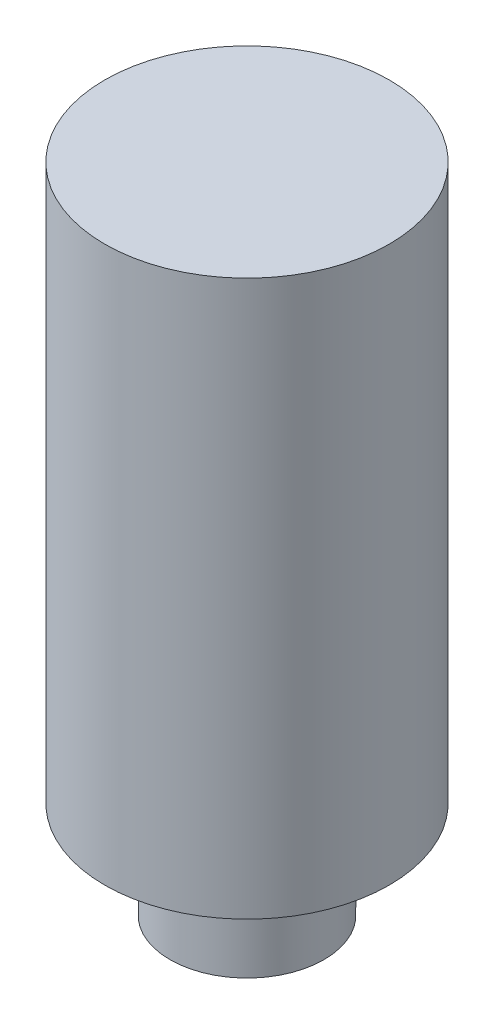
ISO-10303-21;
HEADER;
FILE_DESCRIPTION(('STEP AP214'),'2;1');
FILE_NAME('part.step','',(''),(''),'','','');
FILE_SCHEMA(('AUTOMOTIVE_DESIGN { 1 0 10303 214 1 1 1 1 }'));
ENDSEC;
DATA;
#1=APPLICATION_CONTEXT('core data for automotive mechanical design processes');
#2=APPLICATION_PROTOCOL_DEFINITION('international standard','automotive_design',2000,#1);
#3=PRODUCT_CONTEXT('',#1,'mechanical');
#4=PRODUCT('Part','Part','',(#3));
#5=PRODUCT_RELATED_PRODUCT_CATEGORY('part','',(#4));
#6=PRODUCT_DEFINITION_FORMATION('','',#4);
#7=PRODUCT_DEFINITION_CONTEXT('part definition',#1,'design');
#8=PRODUCT_DEFINITION('design','',#6,#7);
#9=PRODUCT_DEFINITION_SHAPE('','',#8);
#10=(LENGTH_UNIT() NAMED_UNIT(*) SI_UNIT(.MILLI.,.METRE.));
#11=(NAMED_UNIT(*) PLANE_ANGLE_UNIT() SI_UNIT($,.RADIAN.));
#12=(NAMED_UNIT(*) SI_UNIT($,.STERADIAN.) SOLID_ANGLE_UNIT());
#13=UNCERTAINTY_MEASURE_WITH_UNIT(LENGTH_MEASURE(1.E-05),#10,'distance_accuracy_value','');
#14=(GEOMETRIC_REPRESENTATION_CONTEXT(3) GLOBAL_UNCERTAINTY_ASSIGNED_CONTEXT((#13)) GLOBAL_UNIT_ASSIGNED_CONTEXT((#10,
#11,#12)) REPRESENTATION_CONTEXT('',''));
#15=CARTESIAN_POINT('',(0.,0.,0.));
#16=DIRECTION('',(0.,0.,1.));
#17=DIRECTION('',(1.,0.,0.));
#18=AXIS2_PLACEMENT_3D('',#15,#16,#17);
#19=CARTESIAN_POINT('',(0.,40.,0.));
#20=DIRECTION('',(0.,-1.,0.));
#21=DIRECTION('',(0.,0.,-1.));
#22=AXIS2_PLACEMENT_3D('',#19,#20,#21);
#23=CYLINDRICAL_SURFACE('',#22,10.25);
#24=CARTESIAN_POINT('',(0.,40.,0.));
#25=DIRECTION('',(0.,1.,0.));
#26=DIRECTION('',(0.,0.,1.));
#27=AXIS2_PLACEMENT_3D('',#24,#25,#26);
#28=CIRCLE('',#27,10.25);
#29=CARTESIAN_POINT('',(0.,40.,10.25));
#30=VERTEX_POINT('',#29);
#31=EDGE_CURVE('E37',#30,#30,#28,.T.);
#32=ORIENTED_EDGE('',*,*,#31,.F.);
#33=EDGE_LOOP('',(#32));
#34=FACE_BOUND('',#33,.T.);
#35=CARTESIAN_POINT('',(0.,0.,0.));
#36=DIRECTION('',(0.,1.,0.));
#37=DIRECTION('',(0.,0.,1.));
#38=AXIS2_PLACEMENT_3D('',#35,#36,#37);
#39=CIRCLE('',#38,10.25);
#40=CARTESIAN_POINT('',(0.,0.,10.25));
#41=VERTEX_POINT('',#40);
#42=EDGE_CURVE('E41',#41,#41,#39,.T.);
#43=ORIENTED_EDGE('',*,*,#42,.T.);
#44=EDGE_LOOP('',(#43));
#45=FACE_BOUND('',#44,.T.);
#46=ADVANCED_FACE('F31',(#34,#45),#23,.T.);
#47=CARTESIAN_POINT('',(0.,40.,0.));
#48=DIRECTION('',(0.,1.,0.));
#49=DIRECTION('',(0.,0.,1.));
#50=AXIS2_PLACEMENT_3D('',#47,#48,#49);
#51=PLANE('',#50);
#52=ORIENTED_EDGE('',*,*,#31,.T.);
#53=EDGE_LOOP('',(#52));
#54=FACE_BOUND('',#53,.T.);
#55=ADVANCED_FACE('F72',(#54),#51,.T.);
#56=CARTESIAN_POINT('',(0.,0.,0.));
#57=DIRECTION('',(0.,1.,0.));
#58=DIRECTION('',(0.,0.,1.));
#59=AXIS2_PLACEMENT_3D('',#56,#57,#58);
#60=PLANE('',#59);
#61=CARTESIAN_POINT('',(0.,0.,0.));
#62=DIRECTION('',(0.,1.,0.));
#63=DIRECTION('',(0.,0.,1.));
#64=AXIS2_PLACEMENT_3D('',#61,#62,#63);
#65=CIRCLE('',#64,5.55);
#66=CARTESIAN_POINT('',(0.,0.,5.55));
#67=VERTEX_POINT('',#66);
#68=EDGE_CURVE('E10',#67,#67,#65,.F.);
#69=ORIENTED_EDGE('',*,*,#68,.F.);
#70=EDGE_LOOP('',(#69));
#71=FACE_BOUND('',#70,.T.);
#72=ORIENTED_EDGE('',*,*,#42,.F.);
#73=EDGE_LOOP('',(#72));
#74=FACE_BOUND('',#73,.T.);
#75=ADVANCED_FACE('F63',(#71,#74),#60,.F.);
#76=CARTESIAN_POINT('',(0.,-7.,0.));
#77=DIRECTION('',(0.,-1.,0.));
#78=DIRECTION('',(0.,0.,-1.));
#79=AXIS2_PLACEMENT_3D('',#76,#77,#78);
#80=PLANE('',#79);
#81=CARTESIAN_POINT('',(0.,-7.,0.));
#82=DIRECTION('',(0.,-1.,0.));
#83=DIRECTION('',(0.,0.,-1.));
#84=AXIS2_PLACEMENT_3D('',#81,#82,#83);
#85=CIRCLE('',#84,5.55);
#86=CARTESIAN_POINT('',(0.,-7.,-5.55));
#87=VERTEX_POINT('',#86);
#88=EDGE_CURVE('E46',#87,#87,#85,.T.);
#89=ORIENTED_EDGE('',*,*,#88,.T.);
#90=EDGE_LOOP('',(#89));
#91=FACE_BOUND('',#90,.T.);
#92=CARTESIAN_POINT('',(0.,-7.,0.));
#93=DIRECTION('',(0.,-1.,0.));
#94=DIRECTION('',(0.,0.,-1.));
#95=AXIS2_PLACEMENT_3D('',#92,#93,#94);
#96=CIRCLE('',#95,2.45);
#97=CARTESIAN_POINT('',(0.,-7.,-2.45));
#98=VERTEX_POINT('',#97);
#99=EDGE_CURVE('E50',#98,#98,#96,.T.);
#100=ORIENTED_EDGE('',*,*,#99,.F.);
#101=EDGE_LOOP('',(#100));
#102=FACE_BOUND('',#101,.T.);
#103=ADVANCED_FACE('F60',(#91,#102),#80,.T.);
#104=CARTESIAN_POINT('',(0.,-7.,0.));
#105=DIRECTION('',(0.,1.,0.));
#106=DIRECTION('',(0.,0.,1.));
#107=AXIS2_PLACEMENT_3D('',#104,#105,#106);
#108=CYLINDRICAL_SURFACE('',#107,5.55);
#109=ORIENTED_EDGE('',*,*,#88,.F.);
#110=EDGE_LOOP('',(#109));
#111=FACE_BOUND('',#110,.T.);
#112=ORIENTED_EDGE('',*,*,#68,.T.);
#113=EDGE_LOOP('',(#112));
#114=FACE_BOUND('',#113,.T.);
#115=ADVANCED_FACE('F62',(#111,#114),#108,.T.);
#116=CARTESIAN_POINT('',(0.,-7.,0.));
#117=DIRECTION('',(0.,1.,0.));
#118=DIRECTION('',(0.,0.,1.));
#119=AXIS2_PLACEMENT_3D('',#116,#117,#118);
#120=CYLINDRICAL_SURFACE('',#119,2.45);
#121=ORIENTED_EDGE('',*,*,#99,.T.);
#122=EDGE_LOOP('',(#121));
#123=FACE_BOUND('',#122,.T.);
#124=CARTESIAN_POINT('',(0.,0.,0.));
#125=DIRECTION('',(0.,-1.,0.));
#126=DIRECTION('',(0.,0.,-1.));
#127=AXIS2_PLACEMENT_3D('',#124,#125,#126);
#128=CIRCLE('',#127,2.45);
#129=CARTESIAN_POINT('',(0.,0.,-2.45));
#130=VERTEX_POINT('',#129);
#131=EDGE_CURVE('E51',#130,#130,#128,.T.);
#132=ORIENTED_EDGE('',*,*,#131,.F.);
#133=EDGE_LOOP('',(#132));
#134=FACE_BOUND('',#133,.T.);
#135=ADVANCED_FACE('F57',(#123,#134),#120,.F.);
#136=ORIENTED_EDGE('',*,*,#131,.T.);
#137=EDGE_LOOP('',(#136));
#138=FACE_BOUND('',#137,.T.);
#139=ADVANCED_FACE('F74',(#138),#60,.F.);
#140=CLOSED_SHELL('',(#46,#55,#75,#103,#115,#135,#139));
#141=MANIFOLD_SOLID_BREP('B2',#140);
#142=ADVANCED_BREP_SHAPE_REPRESENTATION('',(#18,#141),#14);
#143=SHAPE_DEFINITION_REPRESENTATION(#9,#142);
ENDSEC;
END-ISO-10303-21;
